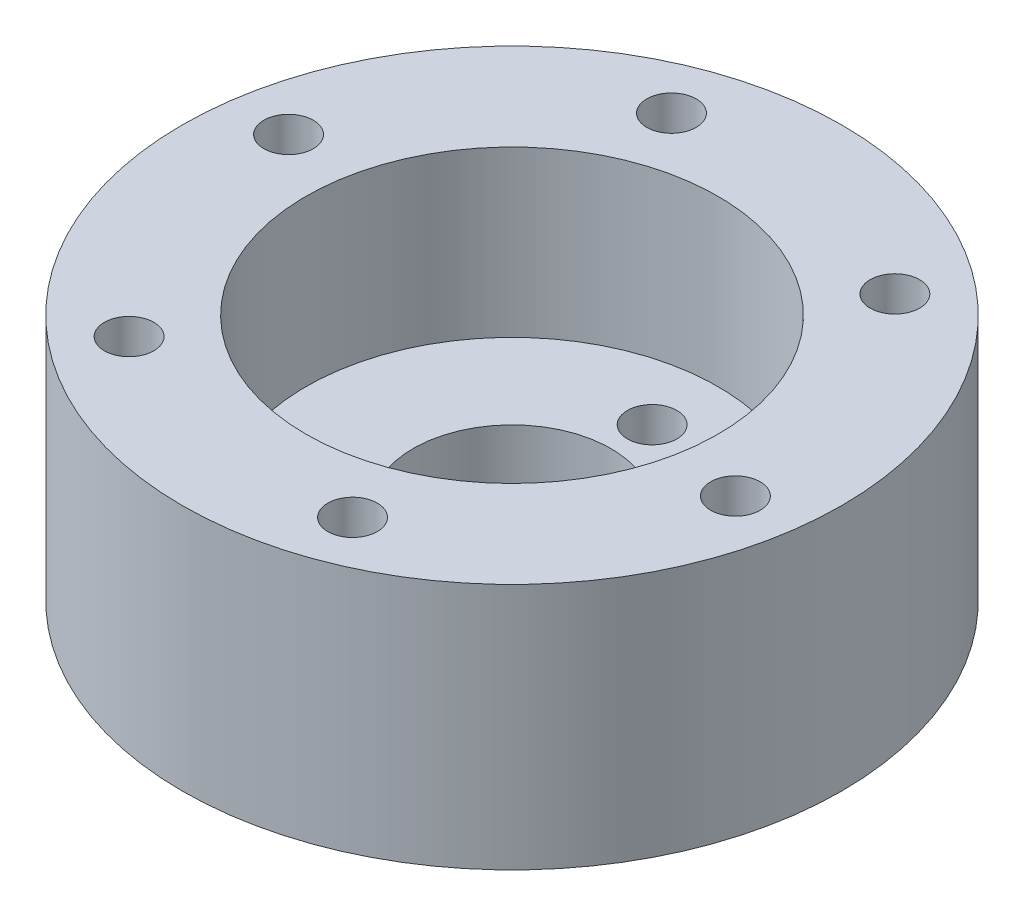
ISO-10303-21;
HEADER;
FILE_DESCRIPTION(('STEP AP214'),'2;1');
FILE_NAME('part.step','',(''),(''),'','','');
FILE_SCHEMA(('AUTOMOTIVE_DESIGN { 1 0 10303 214 1 1 1 1 }'));
ENDSEC;
DATA;
#1=APPLICATION_CONTEXT('core data for automotive mechanical design processes');
#2=APPLICATION_PROTOCOL_DEFINITION('international standard','automotive_design',2000,#1);
#3=PRODUCT_CONTEXT('',#1,'mechanical');
#4=PRODUCT('Part','Part','',(#3));
#5=PRODUCT_RELATED_PRODUCT_CATEGORY('part','',(#4));
#6=PRODUCT_DEFINITION_FORMATION('','',#4);
#7=PRODUCT_DEFINITION_CONTEXT('part definition',#1,'design');
#8=PRODUCT_DEFINITION('design','',#6,#7);
#9=PRODUCT_DEFINITION_SHAPE('','',#8);
#10=(LENGTH_UNIT() NAMED_UNIT(*) SI_UNIT(.MILLI.,.METRE.));
#11=(NAMED_UNIT(*) PLANE_ANGLE_UNIT() SI_UNIT($,.RADIAN.));
#12=(NAMED_UNIT(*) SI_UNIT($,.STERADIAN.) SOLID_ANGLE_UNIT());
#13=UNCERTAINTY_MEASURE_WITH_UNIT(LENGTH_MEASURE(1.E-05),#10,'distance_accuracy_value','');
#14=(GEOMETRIC_REPRESENTATION_CONTEXT(3) GLOBAL_UNCERTAINTY_ASSIGNED_CONTEXT((#13)) GLOBAL_UNIT_ASSIGNED_CONTEXT((#10,
#11,#12)) REPRESENTATION_CONTEXT('',''));
#15=CARTESIAN_POINT('',(0.,0.,0.));
#16=DIRECTION('',(0.,0.,1.));
#17=DIRECTION('',(1.,0.,0.));
#18=AXIS2_PLACEMENT_3D('',#15,#16,#17);
#19=CARTESIAN_POINT('',(0.,15.,0.));
#20=DIRECTION('',(0.,-1.,0.));
#21=DIRECTION('',(0.,0.,-1.));
#22=AXIS2_PLACEMENT_3D('',#19,#20,#21);
#23=CYLINDRICAL_SURFACE('',#22,20.);
#24=CARTESIAN_POINT('',(0.,15.,0.));
#25=DIRECTION('',(0.,1.,0.));
#26=DIRECTION('',(0.,0.,1.));
#27=AXIS2_PLACEMENT_3D('',#24,#25,#26);
#28=CIRCLE('',#27,20.);
#29=CARTESIAN_POINT('',(0.,15.,20.));
#30=VERTEX_POINT('',#29);
#31=EDGE_CURVE('E10',#30,#30,#28,.T.);
#32=ORIENTED_EDGE('',*,*,#31,.F.);
#33=EDGE_LOOP('',(#32));
#34=FACE_BOUND('',#33,.T.);
#35=CARTESIAN_POINT('',(0.,0.,0.));
#36=DIRECTION('',(0.,1.,0.));
#37=DIRECTION('',(0.,0.,1.));
#38=AXIS2_PLACEMENT_3D('',#35,#36,#37);
#39=CIRCLE('',#38,20.);
#40=CARTESIAN_POINT('',(0.,0.,20.));
#41=VERTEX_POINT('',#40);
#42=EDGE_CURVE('E36',#41,#41,#39,.T.);
#43=ORIENTED_EDGE('',*,*,#42,.T.);
#44=EDGE_LOOP('',(#43));
#45=FACE_BOUND('',#44,.T.);
#46=ADVANCED_FACE('F33',(#34,#45),#23,.T.);
#47=CARTESIAN_POINT('',(0.,15.,0.));
#48=DIRECTION('',(0.,1.,0.));
#49=DIRECTION('',(0.,0.,1.));
#50=AXIS2_PLACEMENT_3D('',#47,#48,#49);
#51=PLANE('',#50);
#52=CARTESIAN_POINT('',(5.78104182663744,15.,15.4541112781896));
#53=DIRECTION('',(0.,1.,0.));
#54=DIRECTION('',(0.,0.,1.));
#55=AXIS2_PLACEMENT_3D('',#52,#53,#54);
#56=CIRCLE('',#55,1.5);
#57=CARTESIAN_POINT('',(5.78104182663744,15.,16.9541112781896));
#58=VERTEX_POINT('',#57);
#59=EDGE_CURVE('E87',#58,#58,#56,.T.);
#60=ORIENTED_EDGE('',*,*,#59,.F.);
#61=EDGE_LOOP('',(#60));
#62=FACE_BOUND('',#61,.T.);
#63=CARTESIAN_POINT('',(16.2741738731426,15.,2.72052655688637));
#64=DIRECTION('',(0.,1.,0.));
#65=DIRECTION('',(0.,0.,1.));
#66=AXIS2_PLACEMENT_3D('',#63,#64,#65);
#67=CIRCLE('',#66,1.5);
#68=CARTESIAN_POINT('',(16.2741738731426,15.,4.22052655688636));
#69=VERTEX_POINT('',#68);
#70=EDGE_CURVE('E81',#69,#69,#67,.T.);
#71=ORIENTED_EDGE('',*,*,#70,.F.);
#72=EDGE_LOOP('',(#71));
#73=FACE_BOUND('',#72,.T.);
#74=CARTESIAN_POINT('',(10.4931320465051,15.,-12.7335847213033));
#75=DIRECTION('',(0.,1.,0.));
#76=DIRECTION('',(0.,0.,1.));
#77=AXIS2_PLACEMENT_3D('',#74,#75,#76);
#78=CIRCLE('',#77,1.5);
#79=CARTESIAN_POINT('',(10.4931320465051,15.,-11.2335847213033));
#80=VERTEX_POINT('',#79);
#81=EDGE_CURVE('E75',#80,#80,#78,.T.);
#82=ORIENTED_EDGE('',*,*,#81,.F.);
#83=EDGE_LOOP('',(#82));
#84=FACE_BOUND('',#83,.T.);
#85=CARTESIAN_POINT('',(-5.78104182663755,15.,-15.4541112781896));
#86=DIRECTION('',(0.,1.,0.));
#87=DIRECTION('',(0.,0.,1.));
#88=AXIS2_PLACEMENT_3D('',#85,#86,#87);
#89=CIRCLE('',#88,1.5);
#90=CARTESIAN_POINT('',(-5.78104182663755,15.,-13.9541112781896));
#91=VERTEX_POINT('',#90);
#92=EDGE_CURVE('E69',#91,#91,#89,.T.);
#93=ORIENTED_EDGE('',*,*,#92,.F.);
#94=EDGE_LOOP('',(#93));
#95=FACE_BOUND('',#94,.T.);
#96=CARTESIAN_POINT('',(-16.2741738731426,15.,-2.72052655688625));
#97=DIRECTION('',(0.,1.,0.));
#98=DIRECTION('',(0.,0.,1.));
#99=AXIS2_PLACEMENT_3D('',#96,#97,#98);
#100=CIRCLE('',#99,1.5);
#101=CARTESIAN_POINT('',(-16.2741738731426,15.,-1.22052655688626));
#102=VERTEX_POINT('',#101);
#103=EDGE_CURVE('E63',#102,#102,#100,.T.);
#104=ORIENTED_EDGE('',*,*,#103,.F.);
#105=EDGE_LOOP('',(#104));
#106=FACE_BOUND('',#105,.T.);
#107=CARTESIAN_POINT('',(-10.493132046505,15.,12.7335847213034));
#108=DIRECTION('',(0.,1.,0.));
#109=DIRECTION('',(0.,0.,1.));
#110=AXIS2_PLACEMENT_3D('',#107,#108,#109);
#111=CIRCLE('',#110,1.5);
#112=CARTESIAN_POINT('',(-10.493132046505,15.,14.2335847213034));
#113=VERTEX_POINT('',#112);
#114=EDGE_CURVE('E57',#113,#113,#111,.T.);
#115=ORIENTED_EDGE('',*,*,#114,.F.);
#116=EDGE_LOOP('',(#115));
#117=FACE_BOUND('',#116,.T.);
#118=CARTESIAN_POINT('',(0.,15.,0.));
#119=DIRECTION('',(0.,1.,0.));
#120=DIRECTION('',(0.,0.,1.));
#121=AXIS2_PLACEMENT_3D('',#118,#119,#120);
#122=CIRCLE('',#121,12.5);
#123=CARTESIAN_POINT('',(0.,15.,12.5));
#124=VERTEX_POINT('',#123);
#125=EDGE_CURVE('E45',#124,#124,#122,.T.);
#126=ORIENTED_EDGE('',*,*,#125,.F.);
#127=EDGE_LOOP('',(#126));
#128=FACE_BOUND('',#127,.T.);
#129=ORIENTED_EDGE('',*,*,#31,.T.);
#130=EDGE_LOOP('',(#129));
#131=FACE_BOUND('',#130,.T.);
#132=ADVANCED_FACE('F119',(#62,#73,#84,#95,#106,#117,#128,#131),#51,.T.);
#133=CARTESIAN_POINT('',(0.,0.,0.));
#134=DIRECTION('',(0.,1.,0.));
#135=DIRECTION('',(0.,0.,1.));
#136=AXIS2_PLACEMENT_3D('',#133,#134,#135);
#137=PLANE('',#136);
#138=CARTESIAN_POINT('',(0.,0.,-8.5));
#139=DIRECTION('',(0.,-1.,0.));
#140=DIRECTION('',(0.,0.,-1.));
#141=AXIS2_PLACEMENT_3D('',#138,#139,#140);
#142=CIRCLE('',#141,1.5);
#143=CARTESIAN_POINT('',(0.,0.,-10.));
#144=VERTEX_POINT('',#143);
#145=EDGE_CURVE('E99',#144,#144,#142,.T.);
#146=ORIENTED_EDGE('',*,*,#145,.F.);
#147=EDGE_LOOP('',(#146));
#148=FACE_BOUND('',#147,.T.);
#149=CARTESIAN_POINT('',(0.,0.,8.5));
#150=DIRECTION('',(0.,-1.,0.));
#151=DIRECTION('',(0.,0.,-1.));
#152=AXIS2_PLACEMENT_3D('',#149,#150,#151);
#153=CIRCLE('',#152,1.5);
#154=CARTESIAN_POINT('',(0.,0.,7.));
#155=VERTEX_POINT('',#154);
#156=EDGE_CURVE('E93',#155,#155,#153,.T.);
#157=ORIENTED_EDGE('',*,*,#156,.F.);
#158=EDGE_LOOP('',(#157));
#159=FACE_BOUND('',#158,.T.);
#160=CARTESIAN_POINT('',(5.78104182663744,0.,15.4541112781896));
#161=DIRECTION('',(0.,1.,0.));
#162=DIRECTION('',(0.,0.,1.));
#163=AXIS2_PLACEMENT_3D('',#160,#161,#162);
#164=CIRCLE('',#163,1.5);
#165=CARTESIAN_POINT('',(5.78104182663744,0.,16.9541112781896));
#166=VERTEX_POINT('',#165);
#167=EDGE_CURVE('E84',#166,#166,#164,.T.);
#168=ORIENTED_EDGE('',*,*,#167,.T.);
#169=EDGE_LOOP('',(#168));
#170=FACE_BOUND('',#169,.T.);
#171=CARTESIAN_POINT('',(16.2741738731426,0.,2.72052655688637));
#172=DIRECTION('',(0.,1.,0.));
#173=DIRECTION('',(0.,0.,1.));
#174=AXIS2_PLACEMENT_3D('',#171,#172,#173);
#175=CIRCLE('',#174,1.5);
#176=CARTESIAN_POINT('',(16.2741738731426,0.,4.22052655688636));
#177=VERTEX_POINT('',#176);
#178=EDGE_CURVE('E78',#177,#177,#175,.T.);
#179=ORIENTED_EDGE('',*,*,#178,.T.);
#180=EDGE_LOOP('',(#179));
#181=FACE_BOUND('',#180,.T.);
#182=CARTESIAN_POINT('',(10.4931320465051,0.,-12.7335847213033));
#183=DIRECTION('',(0.,1.,0.));
#184=DIRECTION('',(0.,0.,1.));
#185=AXIS2_PLACEMENT_3D('',#182,#183,#184);
#186=CIRCLE('',#185,1.5);
#187=CARTESIAN_POINT('',(10.4931320465051,0.,-11.2335847213033));
#188=VERTEX_POINT('',#187);
#189=EDGE_CURVE('E72',#188,#188,#186,.T.);
#190=ORIENTED_EDGE('',*,*,#189,.T.);
#191=EDGE_LOOP('',(#190));
#192=FACE_BOUND('',#191,.T.);
#193=CARTESIAN_POINT('',(-5.78104182663755,0.,-15.4541112781896));
#194=DIRECTION('',(0.,1.,0.));
#195=DIRECTION('',(0.,0.,1.));
#196=AXIS2_PLACEMENT_3D('',#193,#194,#195);
#197=CIRCLE('',#196,1.5);
#198=CARTESIAN_POINT('',(-5.78104182663755,0.,-13.9541112781896));
#199=VERTEX_POINT('',#198);
#200=EDGE_CURVE('E66',#199,#199,#197,.T.);
#201=ORIENTED_EDGE('',*,*,#200,.T.);
#202=EDGE_LOOP('',(#201));
#203=FACE_BOUND('',#202,.T.);
#204=CARTESIAN_POINT('',(-16.2741738731426,0.,-2.72052655688625));
#205=DIRECTION('',(0.,1.,0.));
#206=DIRECTION('',(0.,0.,1.));
#207=AXIS2_PLACEMENT_3D('',#204,#205,#206);
#208=CIRCLE('',#207,1.5);
#209=CARTESIAN_POINT('',(-16.2741738731426,0.,-1.22052655688626));
#210=VERTEX_POINT('',#209);
#211=EDGE_CURVE('E60',#210,#210,#208,.T.);
#212=ORIENTED_EDGE('',*,*,#211,.T.);
#213=EDGE_LOOP('',(#212));
#214=FACE_BOUND('',#213,.T.);
#215=CARTESIAN_POINT('',(-10.493132046505,0.,12.7335847213034));
#216=DIRECTION('',(0.,1.,0.));
#217=DIRECTION('',(0.,0.,1.));
#218=AXIS2_PLACEMENT_3D('',#215,#216,#217);
#219=CIRCLE('',#218,1.5);
#220=CARTESIAN_POINT('',(-10.493132046505,0.,14.2335847213034));
#221=VERTEX_POINT('',#220);
#222=EDGE_CURVE('E54',#221,#221,#219,.T.);
#223=ORIENTED_EDGE('',*,*,#222,.T.);
#224=EDGE_LOOP('',(#223));
#225=FACE_BOUND('',#224,.T.);
#226=CARTESIAN_POINT('',(0.,0.,0.));
#227=DIRECTION('',(0.,1.,0.));
#228=DIRECTION('',(0.,0.,1.));
#229=AXIS2_PLACEMENT_3D('',#226,#227,#228);
#230=CIRCLE('',#229,6.);
#231=CARTESIAN_POINT('',(0.,0.,6.));
#232=VERTEX_POINT('',#231);
#233=EDGE_CURVE('E48',#232,#232,#230,.T.);
#234=ORIENTED_EDGE('',*,*,#233,.T.);
#235=EDGE_LOOP('',(#234));
#236=FACE_BOUND('',#235,.T.);
#237=ORIENTED_EDGE('',*,*,#42,.F.);
#238=EDGE_LOOP('',(#237));
#239=FACE_BOUND('',#238,.T.);
#240=ADVANCED_FACE('F115',(#148,#159,#170,#181,#192,#203,#214,#225,#236,#239),#137,.F.);
#241=CARTESIAN_POINT('',(0.,5.,0.));
#242=DIRECTION('',(0.,1.,0.));
#243=DIRECTION('',(0.,0.,1.));
#244=AXIS2_PLACEMENT_3D('',#241,#242,#243);
#245=CYLINDRICAL_SURFACE('',#244,12.5);
#246=CARTESIAN_POINT('',(0.,5.,0.));
#247=DIRECTION('',(0.,1.,0.));
#248=DIRECTION('',(0.,0.,1.));
#249=AXIS2_PLACEMENT_3D('',#246,#247,#248);
#250=CIRCLE('',#249,12.5);
#251=CARTESIAN_POINT('',(0.,5.,12.5));
#252=VERTEX_POINT('',#251);
#253=EDGE_CURVE('E43',#252,#252,#250,.T.);
#254=ORIENTED_EDGE('',*,*,#253,.F.);
#255=EDGE_LOOP('',(#254));
#256=FACE_BOUND('',#255,.T.);
#257=ORIENTED_EDGE('',*,*,#125,.T.);
#258=EDGE_LOOP('',(#257));
#259=FACE_BOUND('',#258,.T.);
#260=ADVANCED_FACE('F118',(#256,#259),#245,.F.);
#261=CARTESIAN_POINT('',(0.,5.,0.));
#262=DIRECTION('',(0.,1.,0.));
#263=DIRECTION('',(0.,0.,1.));
#264=AXIS2_PLACEMENT_3D('',#261,#262,#263);
#265=PLANE('',#264);
#266=CARTESIAN_POINT('',(0.,5.,-8.5));
#267=DIRECTION('',(0.,-1.,0.));
#268=DIRECTION('',(0.,0.,-1.));
#269=AXIS2_PLACEMENT_3D('',#266,#267,#268);
#270=CIRCLE('',#269,1.5);
#271=CARTESIAN_POINT('',(0.,5.,-10.));
#272=VERTEX_POINT('',#271);
#273=EDGE_CURVE('E96',#272,#272,#270,.T.);
#274=ORIENTED_EDGE('',*,*,#273,.T.);
#275=EDGE_LOOP('',(#274));
#276=FACE_BOUND('',#275,.T.);
#277=CARTESIAN_POINT('',(0.,5.,8.5));
#278=DIRECTION('',(0.,-1.,0.));
#279=DIRECTION('',(0.,0.,-1.));
#280=AXIS2_PLACEMENT_3D('',#277,#278,#279);
#281=CIRCLE('',#280,1.5);
#282=CARTESIAN_POINT('',(0.,5.,7.));
#283=VERTEX_POINT('',#282);
#284=EDGE_CURVE('E90',#283,#283,#281,.T.);
#285=ORIENTED_EDGE('',*,*,#284,.T.);
#286=EDGE_LOOP('',(#285));
#287=FACE_BOUND('',#286,.T.);
#288=CARTESIAN_POINT('',(0.,5.,0.));
#289=DIRECTION('',(0.,1.,0.));
#290=DIRECTION('',(0.,0.,1.));
#291=AXIS2_PLACEMENT_3D('',#288,#289,#290);
#292=CIRCLE('',#291,6.);
#293=CARTESIAN_POINT('',(0.,5.,6.));
#294=VERTEX_POINT('',#293);
#295=EDGE_CURVE('E51',#294,#294,#292,.T.);
#296=ORIENTED_EDGE('',*,*,#295,.F.);
#297=EDGE_LOOP('',(#296));
#298=FACE_BOUND('',#297,.T.);
#299=ORIENTED_EDGE('',*,*,#253,.T.);
#300=EDGE_LOOP('',(#299));
#301=FACE_BOUND('',#300,.T.);
#302=ADVANCED_FACE('F105',(#276,#287,#298,#301),#265,.T.);
#303=CARTESIAN_POINT('',(0.,0.,0.));
#304=DIRECTION('',(0.,1.,0.));
#305=DIRECTION('',(0.,0.,1.));
#306=AXIS2_PLACEMENT_3D('',#303,#304,#305);
#307=CYLINDRICAL_SURFACE('',#306,6.);
#308=ORIENTED_EDGE('',*,*,#233,.F.);
#309=EDGE_LOOP('',(#308));
#310=FACE_BOUND('',#309,.T.);
#311=ORIENTED_EDGE('',*,*,#295,.T.);
#312=EDGE_LOOP('',(#311));
#313=FACE_BOUND('',#312,.T.);
#314=ADVANCED_FACE('F155',(#310,#313),#307,.F.);
#315=CARTESIAN_POINT('',(-10.493132046505,0.,12.7335847213034));
#316=DIRECTION('',(0.,1.,0.));
#317=DIRECTION('',(0.,0.,1.));
#318=AXIS2_PLACEMENT_3D('',#315,#316,#317);
#319=CYLINDRICAL_SURFACE('',#318,1.5);
#320=ORIENTED_EDGE('',*,*,#222,.F.);
#321=EDGE_LOOP('',(#320));
#322=FACE_BOUND('',#321,.T.);
#323=ORIENTED_EDGE('',*,*,#114,.T.);
#324=EDGE_LOOP('',(#323));
#325=FACE_BOUND('',#324,.T.);
#326=ADVANCED_FACE('F158',(#322,#325),#319,.F.);
#327=CARTESIAN_POINT('',(-16.2741738731426,0.,-2.72052655688625));
#328=DIRECTION('',(0.,1.,0.));
#329=DIRECTION('',(0.,0.,1.));
#330=AXIS2_PLACEMENT_3D('',#327,#328,#329);
#331=CYLINDRICAL_SURFACE('',#330,1.5);
#332=ORIENTED_EDGE('',*,*,#211,.F.);
#333=EDGE_LOOP('',(#332));
#334=FACE_BOUND('',#333,.T.);
#335=ORIENTED_EDGE('',*,*,#103,.T.);
#336=EDGE_LOOP('',(#335));
#337=FACE_BOUND('',#336,.T.);
#338=ADVANCED_FACE('F162',(#334,#337),#331,.F.);
#339=CARTESIAN_POINT('',(-5.78104182663755,0.,-15.4541112781896));
#340=DIRECTION('',(0.,1.,0.));
#341=DIRECTION('',(0.,0.,1.));
#342=AXIS2_PLACEMENT_3D('',#339,#340,#341);
#343=CYLINDRICAL_SURFACE('',#342,1.5);
#344=ORIENTED_EDGE('',*,*,#200,.F.);
#345=EDGE_LOOP('',(#344));
#346=FACE_BOUND('',#345,.T.);
#347=ORIENTED_EDGE('',*,*,#92,.T.);
#348=EDGE_LOOP('',(#347));
#349=FACE_BOUND('',#348,.T.);
#350=ADVANCED_FACE('F166',(#346,#349),#343,.F.);
#351=CARTESIAN_POINT('',(10.4931320465051,0.,-12.7335847213033));
#352=DIRECTION('',(0.,1.,0.));
#353=DIRECTION('',(0.,0.,1.));
#354=AXIS2_PLACEMENT_3D('',#351,#352,#353);
#355=CYLINDRICAL_SURFACE('',#354,1.5);
#356=ORIENTED_EDGE('',*,*,#189,.F.);
#357=EDGE_LOOP('',(#356));
#358=FACE_BOUND('',#357,.T.);
#359=ORIENTED_EDGE('',*,*,#81,.T.);
#360=EDGE_LOOP('',(#359));
#361=FACE_BOUND('',#360,.T.);
#362=ADVANCED_FACE('F170',(#358,#361),#355,.F.);
#363=CARTESIAN_POINT('',(16.2741738731426,0.,2.72052655688637));
#364=DIRECTION('',(0.,1.,0.));
#365=DIRECTION('',(0.,0.,1.));
#366=AXIS2_PLACEMENT_3D('',#363,#364,#365);
#367=CYLINDRICAL_SURFACE('',#366,1.5);
#368=ORIENTED_EDGE('',*,*,#178,.F.);
#369=EDGE_LOOP('',(#368));
#370=FACE_BOUND('',#369,.T.);
#371=ORIENTED_EDGE('',*,*,#70,.T.);
#372=EDGE_LOOP('',(#371));
#373=FACE_BOUND('',#372,.T.);
#374=ADVANCED_FACE('F174',(#370,#373),#367,.F.);
#375=CARTESIAN_POINT('',(5.78104182663744,0.,15.4541112781896));
#376=DIRECTION('',(0.,1.,0.));
#377=DIRECTION('',(0.,0.,1.));
#378=AXIS2_PLACEMENT_3D('',#375,#376,#377);
#379=CYLINDRICAL_SURFACE('',#378,1.5);
#380=ORIENTED_EDGE('',*,*,#167,.F.);
#381=EDGE_LOOP('',(#380));
#382=FACE_BOUND('',#381,.T.);
#383=ORIENTED_EDGE('',*,*,#59,.T.);
#384=EDGE_LOOP('',(#383));
#385=FACE_BOUND('',#384,.T.);
#386=ADVANCED_FACE('F178',(#382,#385),#379,.F.);
#387=CARTESIAN_POINT('',(0.,5.,8.5));
#388=DIRECTION('',(0.,-1.,0.));
#389=DIRECTION('',(0.,0.,-1.));
#390=AXIS2_PLACEMENT_3D('',#387,#388,#389);
#391=CYLINDRICAL_SURFACE('',#390,1.5);
#392=ORIENTED_EDGE('',*,*,#284,.F.);
#393=EDGE_LOOP('',(#392));
#394=FACE_BOUND('',#393,.T.);
#395=ORIENTED_EDGE('',*,*,#156,.T.);
#396=EDGE_LOOP('',(#395));
#397=FACE_BOUND('',#396,.T.);
#398=ADVANCED_FACE('F111',(#394,#397),#391,.F.);
#399=CARTESIAN_POINT('',(0.,5.,-8.5));
#400=DIRECTION('',(0.,-1.,0.));
#401=DIRECTION('',(0.,0.,-1.));
#402=AXIS2_PLACEMENT_3D('',#399,#400,#401);
#403=CYLINDRICAL_SURFACE('',#402,1.5);
#404=ORIENTED_EDGE('',*,*,#273,.F.);
#405=EDGE_LOOP('',(#404));
#406=FACE_BOUND('',#405,.T.);
#407=ORIENTED_EDGE('',*,*,#145,.T.);
#408=EDGE_LOOP('',(#407));
#409=FACE_BOUND('',#408,.T.);
#410=ADVANCED_FACE('F108',(#406,#409),#403,.F.);
#411=CLOSED_SHELL('',(#46,#132,#240,#260,#302,#314,#326,#338,#350,#362,#374,#386,#398,#410));
#412=MANIFOLD_SOLID_BREP('B2',#411);
#413=ADVANCED_BREP_SHAPE_REPRESENTATION('',(#18,#412),#14);
#414=SHAPE_DEFINITION_REPRESENTATION(#9,#413);
ENDSEC;
END-ISO-10303-21;
